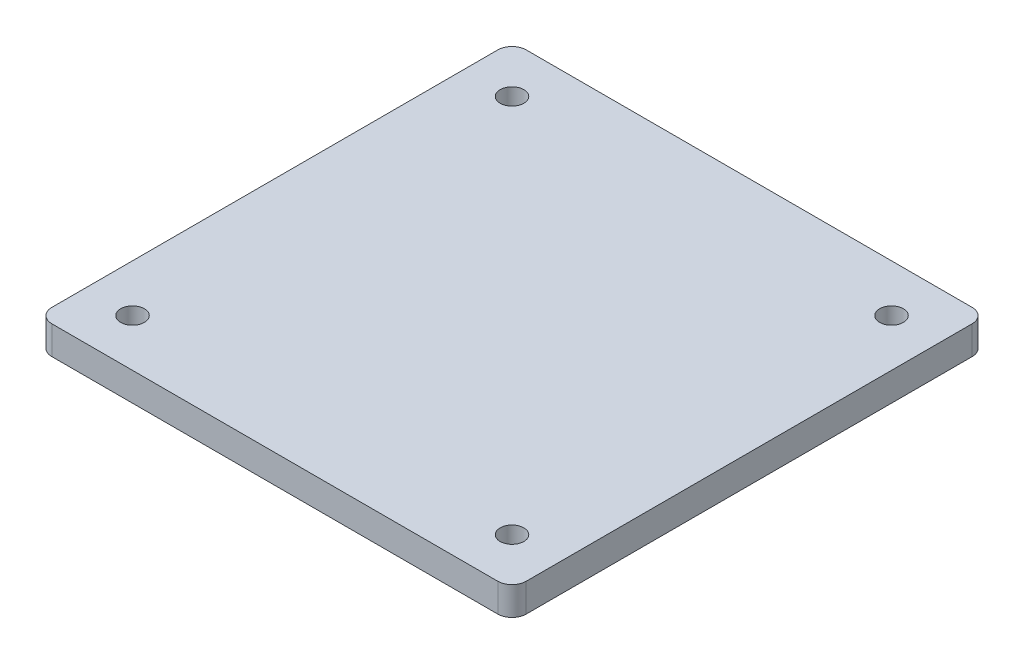
ISO-10303-21;
HEADER;
FILE_DESCRIPTION(('STEP AP214'),'2;1');
FILE_NAME('part.step','',(''),(''),'','','');
FILE_SCHEMA(('AUTOMOTIVE_DESIGN { 1 0 10303 214 1 1 1 1 }'));
ENDSEC;
DATA;
#1=APPLICATION_CONTEXT('core data for automotive mechanical design processes');
#2=APPLICATION_PROTOCOL_DEFINITION('international standard','automotive_design',2000,#1);
#3=PRODUCT_CONTEXT('',#1,'mechanical');
#4=PRODUCT('Part','Part','',(#3));
#5=PRODUCT_RELATED_PRODUCT_CATEGORY('part','',(#4));
#6=PRODUCT_DEFINITION_FORMATION('','',#4);
#7=PRODUCT_DEFINITION_CONTEXT('part definition',#1,'design');
#8=PRODUCT_DEFINITION('design','',#6,#7);
#9=PRODUCT_DEFINITION_SHAPE('','',#8);
#10=(LENGTH_UNIT() NAMED_UNIT(*) SI_UNIT(.MILLI.,.METRE.));
#11=(NAMED_UNIT(*) PLANE_ANGLE_UNIT() SI_UNIT($,.RADIAN.));
#12=(NAMED_UNIT(*) SI_UNIT($,.STERADIAN.) SOLID_ANGLE_UNIT());
#13=UNCERTAINTY_MEASURE_WITH_UNIT(LENGTH_MEASURE(1.E-05),#10,'distance_accuracy_value','');
#14=(GEOMETRIC_REPRESENTATION_CONTEXT(3) GLOBAL_UNCERTAINTY_ASSIGNED_CONTEXT((#13)) GLOBAL_UNIT_ASSIGNED_CONTEXT((#10,
#11,#12)) REPRESENTATION_CONTEXT('',''));
#15=CARTESIAN_POINT('',(0.,0.,0.));
#16=DIRECTION('',(0.,0.,1.));
#17=DIRECTION('',(1.,0.,0.));
#18=AXIS2_PLACEMENT_3D('',#15,#16,#17);
#19=CARTESIAN_POINT('',(-260.000000000006,25.5,-260.));
#20=DIRECTION('',(0.,1.,0.));
#21=DIRECTION('',(0.,0.,1.));
#22=AXIS2_PLACEMENT_3D('',#19,#20,#21);
#23=PLANE('',#22);
#24=CARTESIAN_POINT('',(340.000000000001,25.5,340.));
#25=DIRECTION('',(0.,1.,0.));
#26=DIRECTION('',(0.,0.,1.));
#27=AXIS2_PLACEMENT_3D('',#24,#25,#26);
#28=CIRCLE('',#27,18.7500000000001);
#29=CARTESIAN_POINT('',(340.000000000001,25.5,358.75));
#30=VERTEX_POINT('',#29);
#31=EDGE_CURVE('E216',#30,#30,#28,.T.);
#32=ORIENTED_EDGE('',*,*,#31,.F.);
#33=EDGE_LOOP('',(#32));
#34=FACE_BOUND('',#33,.T.);
#35=CARTESIAN_POINT('',(-260.000000000006,25.5,-260.));
#36=DIRECTION('',(0.,1.,0.));
#37=DIRECTION('',(0.,0.,1.));
#38=AXIS2_PLACEMENT_3D('',#35,#36,#37);
#39=CIRCLE('',#38,18.75);
#40=CARTESIAN_POINT('',(-260.000000000006,25.5,-241.25));
#41=VERTEX_POINT('',#40);
#42=EDGE_CURVE('E135',#41,#41,#39,.T.);
#43=ORIENTED_EDGE('',*,*,#42,.F.);
#44=EDGE_LOOP('',(#43));
#45=FACE_BOUND('',#44,.T.);
#46=DIRECTION('',(-1.,0.,0.));
#47=VECTOR('',#46,1.);
#48=CARTESIAN_POINT('',(-334.999999999999,25.5,-335.));
#49=LINE('',#48,#47);
#50=CARTESIAN_POINT('',(392.500000000001,25.5,-335.));
#51=VERTEX_POINT('',#50);
#52=CARTESIAN_POINT('',(-312.499999999999,25.5,-335.));
#53=VERTEX_POINT('',#52);
#54=EDGE_CURVE('E146',#51,#53,#49,.T.);
#55=ORIENTED_EDGE('',*,*,#54,.T.);
#56=CARTESIAN_POINT('',(-312.499999999999,25.5,-312.5));
#57=DIRECTION('',(0.,1.,0.));
#58=DIRECTION('',(0.,0.,1.));
#59=AXIS2_PLACEMENT_3D('',#56,#57,#58);
#60=CIRCLE('',#59,22.5);
#61=CARTESIAN_POINT('',(-334.999999999999,25.5,-312.5));
#62=VERTEX_POINT('',#61);
#63=EDGE_CURVE('E176',#53,#62,#60,.T.);
#64=ORIENTED_EDGE('',*,*,#63,.T.);
#65=DIRECTION('',(0.,0.,1.));
#66=VECTOR('',#65,1.);
#67=CARTESIAN_POINT('',(-334.999999999999,25.5,-335.));
#68=LINE('',#67,#66);
#69=CARTESIAN_POINT('',(-334.999999999999,25.5,392.5));
#70=VERTEX_POINT('',#69);
#71=EDGE_CURVE('E125',#62,#70,#68,.T.);
#72=ORIENTED_EDGE('',*,*,#71,.T.);
#73=CARTESIAN_POINT('',(-312.499999999999,25.5,392.5));
#74=DIRECTION('',(0.,1.,0.));
#75=DIRECTION('',(0.,0.,1.));
#76=AXIS2_PLACEMENT_3D('',#73,#74,#75);
#77=CIRCLE('',#76,22.5);
#78=CARTESIAN_POINT('',(-312.499999999999,25.5,415.));
#79=VERTEX_POINT('',#78);
#80=EDGE_CURVE('E173',#70,#79,#77,.T.);
#81=ORIENTED_EDGE('',*,*,#80,.T.);
#82=DIRECTION('',(1.,0.,0.));
#83=VECTOR('',#82,1.);
#84=CARTESIAN_POINT('',(-334.999999999999,25.5,415.));
#85=LINE('',#84,#83);
#86=CARTESIAN_POINT('',(392.500000000001,25.5,415.));
#87=VERTEX_POINT('',#86);
#88=EDGE_CURVE('E202',#79,#87,#85,.T.);
#89=ORIENTED_EDGE('',*,*,#88,.T.);
#90=CARTESIAN_POINT('',(392.500000000001,25.5,392.5));
#91=DIRECTION('',(0.,1.,0.));
#92=DIRECTION('',(0.,0.,1.));
#93=AXIS2_PLACEMENT_3D('',#90,#91,#92);
#94=CIRCLE('',#93,22.5);
#95=CARTESIAN_POINT('',(415.000000000001,25.5,392.5));
#96=VERTEX_POINT('',#95);
#97=EDGE_CURVE('E59',#87,#96,#94,.T.);
#98=ORIENTED_EDGE('',*,*,#97,.T.);
#99=DIRECTION('',(0.,0.,-1.));
#100=VECTOR('',#99,1.);
#101=CARTESIAN_POINT('',(415.000000000001,25.5,-335.));
#102=LINE('',#101,#100);
#103=CARTESIAN_POINT('',(415.000000000001,25.5,-312.5));
#104=VERTEX_POINT('',#103);
#105=EDGE_CURVE('E190',#96,#104,#102,.T.);
#106=ORIENTED_EDGE('',*,*,#105,.T.);
#107=CARTESIAN_POINT('',(392.500000000001,25.5,-312.5));
#108=DIRECTION('',(0.,1.,0.));
#109=DIRECTION('',(0.,0.,1.));
#110=AXIS2_PLACEMENT_3D('',#107,#108,#109);
#111=CIRCLE('',#110,22.5);
#112=EDGE_CURVE('E170',#104,#51,#111,.T.);
#113=ORIENTED_EDGE('',*,*,#112,.T.);
#114=EDGE_LOOP('',(#55,#64,#72,#81,#89,#98,#106,#113));
#115=FACE_BOUND('',#114,.T.);
#116=CARTESIAN_POINT('',(339.999999999995,25.5,-260.));
#117=DIRECTION('',(0.,1.,0.));
#118=DIRECTION('',(0.,0.,1.));
#119=AXIS2_PLACEMENT_3D('',#116,#117,#118);
#120=CIRCLE('',#119,18.7500000000001);
#121=CARTESIAN_POINT('',(339.999999999995,25.5,-241.25));
#122=VERTEX_POINT('',#121);
#123=EDGE_CURVE('E210',#122,#122,#120,.T.);
#124=ORIENTED_EDGE('',*,*,#123,.F.);
#125=EDGE_LOOP('',(#124));
#126=FACE_BOUND('',#125,.T.);
#127=CARTESIAN_POINT('',(-259.999999999999,25.5,340.));
#128=DIRECTION('',(0.,1.,0.));
#129=DIRECTION('',(0.,0.,1.));
#130=AXIS2_PLACEMENT_3D('',#127,#128,#129);
#131=CIRCLE('',#130,18.75);
#132=CARTESIAN_POINT('',(-259.999999999999,25.5,358.75));
#133=VERTEX_POINT('',#132);
#134=EDGE_CURVE('E224',#133,#133,#131,.T.);
#135=ORIENTED_EDGE('',*,*,#134,.F.);
#136=EDGE_LOOP('',(#135));
#137=FACE_BOUND('',#136,.T.);
#138=ADVANCED_FACE('F38',(#34,#45,#115,#126,#137),#23,.T.);
#139=CARTESIAN_POINT('',(-260.000000000006,-19.5,-260.));
#140=DIRECTION('',(0.,1.,0.));
#141=DIRECTION('',(0.,0.,1.));
#142=AXIS2_PLACEMENT_3D('',#139,#140,#141);
#143=PLANE('',#142);
#144=CARTESIAN_POINT('',(340.000000000001,-19.5,340.));
#145=DIRECTION('',(0.,1.,0.));
#146=DIRECTION('',(0.,0.,1.));
#147=AXIS2_PLACEMENT_3D('',#144,#145,#146);
#148=CIRCLE('',#147,18.7500000000001);
#149=CARTESIAN_POINT('',(340.000000000001,-19.5,358.75));
#150=VERTEX_POINT('',#149);
#151=EDGE_CURVE('E220',#150,#150,#148,.T.);
#152=ORIENTED_EDGE('',*,*,#151,.T.);
#153=EDGE_LOOP('',(#152));
#154=FACE_BOUND('',#153,.T.);
#155=CARTESIAN_POINT('',(-260.000000000006,-19.5,-260.));
#156=DIRECTION('',(0.,1.,0.));
#157=DIRECTION('',(0.,0.,1.));
#158=AXIS2_PLACEMENT_3D('',#155,#156,#157);
#159=CIRCLE('',#158,18.75);
#160=CARTESIAN_POINT('',(-260.000000000006,-19.5,-241.25));
#161=VERTEX_POINT('',#160);
#162=EDGE_CURVE('E143',#161,#161,#159,.T.);
#163=ORIENTED_EDGE('',*,*,#162,.T.);
#164=EDGE_LOOP('',(#163));
#165=FACE_BOUND('',#164,.T.);
#166=DIRECTION('',(0.,0.,1.));
#167=VECTOR('',#166,1.);
#168=CARTESIAN_POINT('',(-334.999999999999,-19.5,-335.));
#169=LINE('',#168,#167);
#170=CARTESIAN_POINT('',(-334.999999999999,-19.5,-312.5));
#171=VERTEX_POINT('',#170);
#172=CARTESIAN_POINT('',(-334.999999999999,-19.5,392.5));
#173=VERTEX_POINT('',#172);
#174=EDGE_CURVE('E122',#171,#173,#169,.T.);
#175=ORIENTED_EDGE('',*,*,#174,.F.);
#176=CARTESIAN_POINT('',(-312.499999999999,-19.5,-312.5));
#177=DIRECTION('',(0.,1.,0.));
#178=DIRECTION('',(0.,0.,1.));
#179=AXIS2_PLACEMENT_3D('',#176,#177,#178);
#180=CIRCLE('',#179,22.5);
#181=CARTESIAN_POINT('',(-312.499999999999,-19.5,-335.));
#182=VERTEX_POINT('',#181);
#183=EDGE_CURVE('E104',#171,#182,#180,.F.);
#184=ORIENTED_EDGE('',*,*,#183,.T.);
#185=DIRECTION('',(-1.,0.,0.));
#186=VECTOR('',#185,1.);
#187=CARTESIAN_POINT('',(-334.999999999999,-19.5,-335.));
#188=LINE('',#187,#186);
#189=CARTESIAN_POINT('',(392.500000000001,-19.5,-335.));
#190=VERTEX_POINT('',#189);
#191=EDGE_CURVE('E151',#190,#182,#188,.T.);
#192=ORIENTED_EDGE('',*,*,#191,.F.);
#193=CARTESIAN_POINT('',(392.500000000001,-19.5,-312.5));
#194=DIRECTION('',(0.,1.,0.));
#195=DIRECTION('',(0.,0.,1.));
#196=AXIS2_PLACEMENT_3D('',#193,#194,#195);
#197=CIRCLE('',#196,22.5);
#198=CARTESIAN_POINT('',(415.000000000001,-19.5,-312.5));
#199=VERTEX_POINT('',#198);
#200=EDGE_CURVE('E158',#190,#199,#197,.F.);
#201=ORIENTED_EDGE('',*,*,#200,.T.);
#202=DIRECTION('',(0.,0.,-1.));
#203=VECTOR('',#202,1.);
#204=CARTESIAN_POINT('',(415.000000000001,-19.5,-335.));
#205=LINE('',#204,#203);
#206=CARTESIAN_POINT('',(415.000000000001,-19.5,392.5));
#207=VERTEX_POINT('',#206);
#208=EDGE_CURVE('E140',#207,#199,#205,.T.);
#209=ORIENTED_EDGE('',*,*,#208,.F.);
#210=CARTESIAN_POINT('',(392.500000000001,-19.5,392.5));
#211=DIRECTION('',(0.,1.,0.));
#212=DIRECTION('',(0.,0.,1.));
#213=AXIS2_PLACEMENT_3D('',#210,#211,#212);
#214=CIRCLE('',#213,22.5);
#215=CARTESIAN_POINT('',(392.500000000001,-19.5,415.));
#216=VERTEX_POINT('',#215);
#217=EDGE_CURVE('E127',#207,#216,#214,.F.);
#218=ORIENTED_EDGE('',*,*,#217,.T.);
#219=DIRECTION('',(1.,0.,0.));
#220=VECTOR('',#219,1.);
#221=CARTESIAN_POINT('',(-334.999999999999,-19.5,415.));
#222=LINE('',#221,#220);
#223=CARTESIAN_POINT('',(-312.499999999999,-19.5,415.));
#224=VERTEX_POINT('',#223);
#225=EDGE_CURVE('E134',#224,#216,#222,.T.);
#226=ORIENTED_EDGE('',*,*,#225,.F.);
#227=CARTESIAN_POINT('',(-312.499999999999,-19.5,392.5));
#228=DIRECTION('',(0.,1.,0.));
#229=DIRECTION('',(0.,0.,1.));
#230=AXIS2_PLACEMENT_3D('',#227,#228,#229);
#231=CIRCLE('',#230,22.5);
#232=EDGE_CURVE('E116',#224,#173,#231,.F.);
#233=ORIENTED_EDGE('',*,*,#232,.T.);
#234=EDGE_LOOP('',(#175,#184,#192,#201,#209,#218,#226,#233));
#235=FACE_BOUND('',#234,.T.);
#236=CARTESIAN_POINT('',(339.999999999995,-19.5,-260.));
#237=DIRECTION('',(0.,1.,0.));
#238=DIRECTION('',(0.,0.,1.));
#239=AXIS2_PLACEMENT_3D('',#236,#237,#238);
#240=CIRCLE('',#239,18.7500000000001);
#241=CARTESIAN_POINT('',(339.999999999995,-19.5,-241.25));
#242=VERTEX_POINT('',#241);
#243=EDGE_CURVE('E212',#242,#242,#240,.T.);
#244=ORIENTED_EDGE('',*,*,#243,.T.);
#245=EDGE_LOOP('',(#244));
#246=FACE_BOUND('',#245,.T.);
#247=CARTESIAN_POINT('',(-259.999999999999,-19.5,340.));
#248=DIRECTION('',(0.,1.,0.));
#249=DIRECTION('',(0.,0.,1.));
#250=AXIS2_PLACEMENT_3D('',#247,#248,#249);
#251=CIRCLE('',#250,18.75);
#252=CARTESIAN_POINT('',(-259.999999999999,-19.5,358.75));
#253=VERTEX_POINT('',#252);
#254=EDGE_CURVE('E228',#253,#253,#251,.T.);
#255=ORIENTED_EDGE('',*,*,#254,.T.);
#256=EDGE_LOOP('',(#255));
#257=FACE_BOUND('',#256,.T.);
#258=ADVANCED_FACE('F130',(#154,#165,#235,#246,#257),#143,.F.);
#259=CARTESIAN_POINT('',(-334.999999999999,25.5,-335.));
#260=DIRECTION('',(1.,0.,0.));
#261=DIRECTION('',(0.,0.,-1.));
#262=AXIS2_PLACEMENT_3D('',#259,#260,#261);
#263=PLANE('',#262);
#264=ORIENTED_EDGE('',*,*,#71,.F.);
#265=DIRECTION('',(0.,-1.,0.));
#266=VECTOR('',#265,1.);
#267=CARTESIAN_POINT('',(-334.999999999999,25.5,-312.5));
#268=LINE('',#267,#266);
#269=EDGE_CURVE('E108',#62,#171,#268,.T.);
#270=ORIENTED_EDGE('',*,*,#269,.T.);
#271=ORIENTED_EDGE('',*,*,#174,.T.);
#272=DIRECTION('',(0.,-1.,0.));
#273=VECTOR('',#272,1.);
#274=CARTESIAN_POINT('',(-334.999999999999,25.5,392.5));
#275=LINE('',#274,#273);
#276=EDGE_CURVE('E128',#173,#70,#275,.F.);
#277=ORIENTED_EDGE('',*,*,#276,.T.);
#278=EDGE_LOOP('',(#264,#270,#271,#277));
#279=FACE_BOUND('',#278,.T.);
#280=ADVANCED_FACE('F121',(#279),#263,.F.);
#281=CARTESIAN_POINT('',(-334.999999999999,25.5,415.));
#282=DIRECTION('',(0.,0.,-1.));
#283=DIRECTION('',(-1.,0.,0.));
#284=AXIS2_PLACEMENT_3D('',#281,#282,#283);
#285=PLANE('',#284);
#286=ORIENTED_EDGE('',*,*,#88,.F.);
#287=DIRECTION('',(0.,-1.,0.));
#288=VECTOR('',#287,1.);
#289=CARTESIAN_POINT('',(-312.499999999999,25.5,415.));
#290=LINE('',#289,#288);
#291=EDGE_CURVE('E182',#79,#224,#290,.T.);
#292=ORIENTED_EDGE('',*,*,#291,.T.);
#293=ORIENTED_EDGE('',*,*,#225,.T.);
#294=DIRECTION('',(0.,-1.,0.));
#295=VECTOR('',#294,1.);
#296=CARTESIAN_POINT('',(392.500000000001,25.5,415.));
#297=LINE('',#296,#295);
#298=EDGE_CURVE('E179',#216,#87,#297,.F.);
#299=ORIENTED_EDGE('',*,*,#298,.T.);
#300=EDGE_LOOP('',(#286,#292,#293,#299));
#301=FACE_BOUND('',#300,.T.);
#302=ADVANCED_FACE('F257',(#301),#285,.F.);
#303=CARTESIAN_POINT('',(415.000000000001,25.5,-335.));
#304=DIRECTION('',(-1.,0.,0.));
#305=DIRECTION('',(0.,0.,1.));
#306=AXIS2_PLACEMENT_3D('',#303,#304,#305);
#307=PLANE('',#306);
#308=ORIENTED_EDGE('',*,*,#208,.T.);
#309=DIRECTION('',(0.,-1.,0.));
#310=VECTOR('',#309,1.);
#311=CARTESIAN_POINT('',(415.000000000001,25.5,-312.5));
#312=LINE('',#311,#310);
#313=EDGE_CURVE('E11',#199,#104,#312,.F.);
#314=ORIENTED_EDGE('',*,*,#313,.T.);
#315=ORIENTED_EDGE('',*,*,#105,.F.);
#316=DIRECTION('',(0.,-1.,0.));
#317=VECTOR('',#316,1.);
#318=CARTESIAN_POINT('',(415.000000000001,25.5,392.5));
#319=LINE('',#318,#317);
#320=EDGE_CURVE('E47',#96,#207,#319,.T.);
#321=ORIENTED_EDGE('',*,*,#320,.T.);
#322=EDGE_LOOP('',(#308,#314,#315,#321));
#323=FACE_BOUND('',#322,.T.);
#324=ADVANCED_FACE('F189',(#323),#307,.F.);
#325=CARTESIAN_POINT('',(-334.999999999999,25.5,-335.));
#326=DIRECTION('',(0.,0.,1.));
#327=DIRECTION('',(1.,0.,0.));
#328=AXIS2_PLACEMENT_3D('',#325,#326,#327);
#329=PLANE('',#328);
#330=ORIENTED_EDGE('',*,*,#191,.T.);
#331=DIRECTION('',(0.,-1.,0.));
#332=VECTOR('',#331,1.);
#333=CARTESIAN_POINT('',(-312.499999999999,25.5,-335.));
#334=LINE('',#333,#332);
#335=EDGE_CURVE('E109',#182,#53,#334,.F.);
#336=ORIENTED_EDGE('',*,*,#335,.T.);
#337=ORIENTED_EDGE('',*,*,#54,.F.);
#338=DIRECTION('',(0.,-1.,0.));
#339=VECTOR('',#338,1.);
#340=CARTESIAN_POINT('',(392.500000000001,25.5,-335.));
#341=LINE('',#340,#339);
#342=EDGE_CURVE('E115',#51,#190,#341,.T.);
#343=ORIENTED_EDGE('',*,*,#342,.T.);
#344=EDGE_LOOP('',(#330,#336,#337,#343));
#345=FACE_BOUND('',#344,.T.);
#346=ADVANCED_FACE('F198',(#345),#329,.F.);
#347=CARTESIAN_POINT('',(-260.000000000006,25.5,-260.));
#348=DIRECTION('',(0.,-1.,0.));
#349=DIRECTION('',(0.,0.,-1.));
#350=AXIS2_PLACEMENT_3D('',#347,#348,#349);
#351=CYLINDRICAL_SURFACE('',#350,18.75);
#352=ORIENTED_EDGE('',*,*,#42,.T.);
#353=EDGE_LOOP('',(#352));
#354=FACE_BOUND('',#353,.T.);
#355=ORIENTED_EDGE('',*,*,#162,.F.);
#356=EDGE_LOOP('',(#355));
#357=FACE_BOUND('',#356,.T.);
#358=ADVANCED_FACE('F250',(#354,#357),#351,.F.);
#359=CARTESIAN_POINT('',(339.999999999995,25.5,-260.));
#360=DIRECTION('',(0.,-1.,0.));
#361=DIRECTION('',(0.,0.,-1.));
#362=AXIS2_PLACEMENT_3D('',#359,#360,#361);
#363=CYLINDRICAL_SURFACE('',#362,18.7500000000001);
#364=ORIENTED_EDGE('',*,*,#123,.T.);
#365=EDGE_LOOP('',(#364));
#366=FACE_BOUND('',#365,.T.);
#367=ORIENTED_EDGE('',*,*,#243,.F.);
#368=EDGE_LOOP('',(#367));
#369=FACE_BOUND('',#368,.T.);
#370=ADVANCED_FACE('F281',(#366,#369),#363,.F.);
#371=CARTESIAN_POINT('',(340.000000000001,25.5,340.));
#372=DIRECTION('',(0.,-1.,0.));
#373=DIRECTION('',(0.,0.,-1.));
#374=AXIS2_PLACEMENT_3D('',#371,#372,#373);
#375=CYLINDRICAL_SURFACE('',#374,18.7500000000001);
#376=ORIENTED_EDGE('',*,*,#31,.T.);
#377=EDGE_LOOP('',(#376));
#378=FACE_BOUND('',#377,.T.);
#379=ORIENTED_EDGE('',*,*,#151,.F.);
#380=EDGE_LOOP('',(#379));
#381=FACE_BOUND('',#380,.T.);
#382=ADVANCED_FACE('F284',(#378,#381),#375,.F.);
#383=CARTESIAN_POINT('',(-259.999999999999,25.5,340.));
#384=DIRECTION('',(0.,-1.,0.));
#385=DIRECTION('',(0.,0.,-1.));
#386=AXIS2_PLACEMENT_3D('',#383,#384,#385);
#387=CYLINDRICAL_SURFACE('',#386,18.75);
#388=ORIENTED_EDGE('',*,*,#134,.T.);
#389=EDGE_LOOP('',(#388));
#390=FACE_BOUND('',#389,.T.);
#391=ORIENTED_EDGE('',*,*,#254,.F.);
#392=EDGE_LOOP('',(#391));
#393=FACE_BOUND('',#392,.T.);
#394=ADVANCED_FACE('F236',(#390,#393),#387,.F.);
#395=CARTESIAN_POINT('',(-312.499999999999,25.5,-312.5));
#396=DIRECTION('',(0.,-1.,0.));
#397=DIRECTION('',(0.,0.,-1.));
#398=AXIS2_PLACEMENT_3D('',#395,#396,#397);
#399=CYLINDRICAL_SURFACE('',#398,22.5);
#400=ORIENTED_EDGE('',*,*,#63,.F.);
#401=ORIENTED_EDGE('',*,*,#335,.F.);
#402=ORIENTED_EDGE('',*,*,#183,.F.);
#403=ORIENTED_EDGE('',*,*,#269,.F.);
#404=EDGE_LOOP('',(#400,#401,#402,#403));
#405=FACE_BOUND('',#404,.T.);
#406=ADVANCED_FACE('F107',(#405),#399,.T.);
#407=CARTESIAN_POINT('',(-312.499999999999,25.5,392.5));
#408=DIRECTION('',(0.,-1.,0.));
#409=DIRECTION('',(0.,0.,-1.));
#410=AXIS2_PLACEMENT_3D('',#407,#408,#409);
#411=CYLINDRICAL_SURFACE('',#410,22.5);
#412=ORIENTED_EDGE('',*,*,#80,.F.);
#413=ORIENTED_EDGE('',*,*,#276,.F.);
#414=ORIENTED_EDGE('',*,*,#232,.F.);
#415=ORIENTED_EDGE('',*,*,#291,.F.);
#416=EDGE_LOOP('',(#412,#413,#414,#415));
#417=FACE_BOUND('',#416,.T.);
#418=ADVANCED_FACE('F265',(#417),#411,.T.);
#419=CARTESIAN_POINT('',(392.500000000001,25.5,-312.5));
#420=DIRECTION('',(0.,-1.,0.));
#421=DIRECTION('',(0.,0.,-1.));
#422=AXIS2_PLACEMENT_3D('',#419,#420,#421);
#423=CYLINDRICAL_SURFACE('',#422,22.5);
#424=ORIENTED_EDGE('',*,*,#112,.F.);
#425=ORIENTED_EDGE('',*,*,#313,.F.);
#426=ORIENTED_EDGE('',*,*,#200,.F.);
#427=ORIENTED_EDGE('',*,*,#342,.F.);
#428=EDGE_LOOP('',(#424,#425,#426,#427));
#429=FACE_BOUND('',#428,.T.);
#430=ADVANCED_FACE('F195',(#429),#423,.T.);
#431=CARTESIAN_POINT('',(392.500000000001,25.5,392.5));
#432=DIRECTION('',(0.,-1.,0.));
#433=DIRECTION('',(0.,0.,-1.));
#434=AXIS2_PLACEMENT_3D('',#431,#432,#433);
#435=CYLINDRICAL_SURFACE('',#434,22.5);
#436=ORIENTED_EDGE('',*,*,#97,.F.);
#437=ORIENTED_EDGE('',*,*,#298,.F.);
#438=ORIENTED_EDGE('',*,*,#217,.F.);
#439=ORIENTED_EDGE('',*,*,#320,.F.);
#440=EDGE_LOOP('',(#436,#437,#438,#439));
#441=FACE_BOUND('',#440,.T.);
#442=ADVANCED_FACE('F40',(#441),#435,.T.);
#443=CLOSED_SHELL('',(#138,#258,#280,#302,#324,#346,#358,#370,#382,#394,#406,#418,#430,#442));
#444=MANIFOLD_SOLID_BREP('B2',#443);
#445=ADVANCED_BREP_SHAPE_REPRESENTATION('',(#18,#444),#14);
#446=SHAPE_DEFINITION_REPRESENTATION(#9,#445);
ENDSEC;
END-ISO-10303-21;
